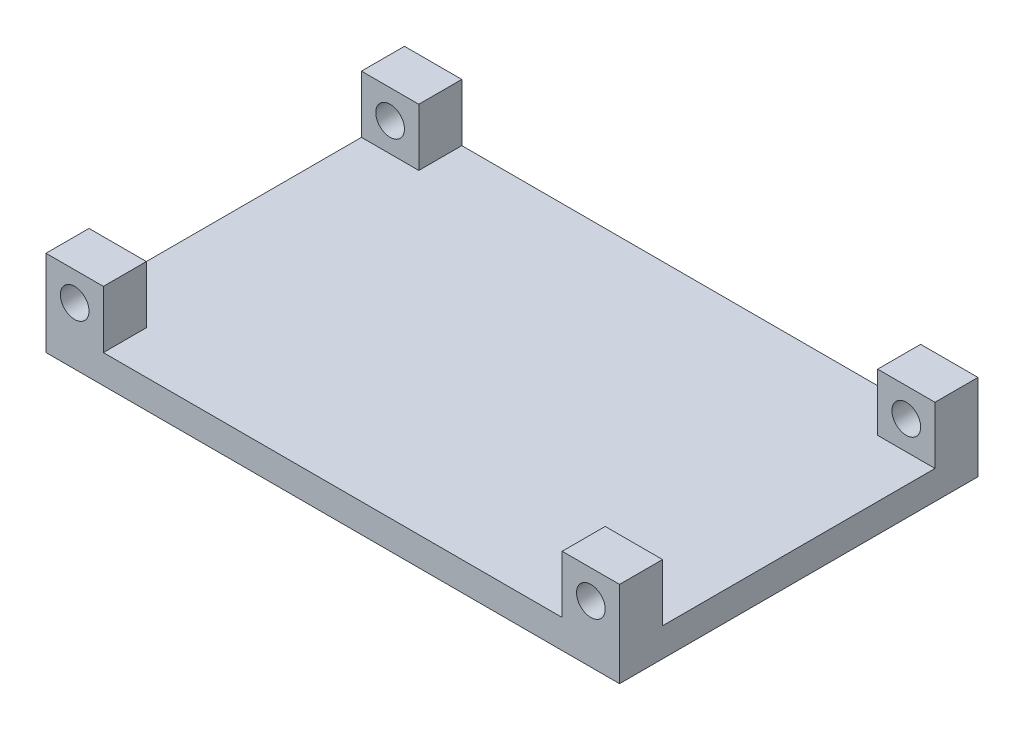
ISO-10303-21;
HEADER;
FILE_DESCRIPTION(('STEP AP214'),'2;1');
FILE_NAME('part.step','',(''),(''),'','','');
FILE_SCHEMA(('AUTOMOTIVE_DESIGN { 1 0 10303 214 1 1 1 1 }'));
ENDSEC;
DATA;
#1=APPLICATION_CONTEXT('core data for automotive mechanical design processes');
#2=APPLICATION_PROTOCOL_DEFINITION('international standard','automotive_design',2000,#1);
#3=PRODUCT_CONTEXT('',#1,'mechanical');
#4=PRODUCT('Part','Part','',(#3));
#5=PRODUCT_RELATED_PRODUCT_CATEGORY('part','',(#4));
#6=PRODUCT_DEFINITION_FORMATION('','',#4);
#7=PRODUCT_DEFINITION_CONTEXT('part definition',#1,'design');
#8=PRODUCT_DEFINITION('design','',#6,#7);
#9=PRODUCT_DEFINITION_SHAPE('','',#8);
#10=(LENGTH_UNIT() NAMED_UNIT(*) SI_UNIT(.MILLI.,.METRE.));
#11=(NAMED_UNIT(*) PLANE_ANGLE_UNIT() SI_UNIT($,.RADIAN.));
#12=(NAMED_UNIT(*) SI_UNIT($,.STERADIAN.) SOLID_ANGLE_UNIT());
#13=UNCERTAINTY_MEASURE_WITH_UNIT(LENGTH_MEASURE(1.E-05),#10,'distance_accuracy_value','');
#14=(GEOMETRIC_REPRESENTATION_CONTEXT(3) GLOBAL_UNCERTAINTY_ASSIGNED_CONTEXT((#13)) GLOBAL_UNIT_ASSIGNED_CONTEXT((#10,
#11,#12)) REPRESENTATION_CONTEXT('',''));
#15=CARTESIAN_POINT('',(0.,0.,0.));
#16=DIRECTION('',(0.,0.,1.));
#17=DIRECTION('',(1.,0.,0.));
#18=AXIS2_PLACEMENT_3D('',#15,#16,#17);
#19=CARTESIAN_POINT('',(0.,20.,0.));
#20=DIRECTION('',(0.,-1.,0.));
#21=DIRECTION('',(0.,0.,-1.));
#22=AXIS2_PLACEMENT_3D('',#19,#20,#21);
#23=PLANE('',#22);
#24=DIRECTION('',(1.,0.,0.));
#25=VECTOR('',#24,1.);
#26=CARTESIAN_POINT('',(200.,20.,-95.));
#27=LINE('',#26,#25);
#28=CARTESIAN_POINT('',(160.,20.,-95.));
#29=VERTEX_POINT('',#28);
#30=CARTESIAN_POINT('',(200.,20.,-95.));
#31=VERTEX_POINT('',#30);
#32=EDGE_CURVE('E145',#29,#31,#27,.T.);
#33=ORIENTED_EDGE('',*,*,#32,.F.);
#34=DIRECTION('',(0.,0.,-1.));
#35=VECTOR('',#34,1.);
#36=CARTESIAN_POINT('',(160.,20.,-95.));
#37=LINE('',#36,#35);
#38=CARTESIAN_POINT('',(160.,20.,-125.));
#39=VERTEX_POINT('',#38);
#40=EDGE_CURVE('E52',#29,#39,#37,.T.);
#41=ORIENTED_EDGE('',*,*,#40,.T.);
#42=DIRECTION('',(1.,0.,0.));
#43=VECTOR('',#42,1.);
#44=CARTESIAN_POINT('',(-200.,20.,-125.));
#45=LINE('',#44,#43);
#46=CARTESIAN_POINT('',(-160.,20.,-125.));
#47=VERTEX_POINT('',#46);
#48=EDGE_CURVE('E269',#47,#39,#45,.T.);
#49=ORIENTED_EDGE('',*,*,#48,.F.);
#50=DIRECTION('',(0.,0.,-1.));
#51=VECTOR('',#50,1.);
#52=CARTESIAN_POINT('',(-160.,20.,-95.));
#53=LINE('',#52,#51);
#54=CARTESIAN_POINT('',(-160.,20.,-95.));
#55=VERTEX_POINT('',#54);
#56=EDGE_CURVE('E194',#55,#47,#53,.T.);
#57=ORIENTED_EDGE('',*,*,#56,.F.);
#58=DIRECTION('',(1.,0.,0.));
#59=VECTOR('',#58,1.);
#60=CARTESIAN_POINT('',(-200.,20.,-95.));
#61=LINE('',#60,#59);
#62=CARTESIAN_POINT('',(-200.,20.,-95.));
#63=VERTEX_POINT('',#62);
#64=EDGE_CURVE('E187',#63,#55,#61,.T.);
#65=ORIENTED_EDGE('',*,*,#64,.F.);
#66=DIRECTION('',(0.,0.,-1.));
#67=VECTOR('',#66,1.);
#68=CARTESIAN_POINT('',(-200.,20.,125.));
#69=LINE('',#68,#67);
#70=CARTESIAN_POINT('',(-200.,20.,95.));
#71=VERTEX_POINT('',#70);
#72=EDGE_CURVE('E266',#71,#63,#69,.T.);
#73=ORIENTED_EDGE('',*,*,#72,.F.);
#74=DIRECTION('',(1.,0.,0.));
#75=VECTOR('',#74,1.);
#76=CARTESIAN_POINT('',(-200.,20.,95.));
#77=LINE('',#76,#75);
#78=CARTESIAN_POINT('',(-160.,20.,95.));
#79=VERTEX_POINT('',#78);
#80=EDGE_CURVE('E243',#71,#79,#77,.T.);
#81=ORIENTED_EDGE('',*,*,#80,.T.);
#82=DIRECTION('',(0.,0.,1.));
#83=VECTOR('',#82,1.);
#84=CARTESIAN_POINT('',(-160.,20.,95.));
#85=LINE('',#84,#83);
#86=CARTESIAN_POINT('',(-160.,20.,125.));
#87=VERTEX_POINT('',#86);
#88=EDGE_CURVE('E253',#79,#87,#85,.T.);
#89=ORIENTED_EDGE('',*,*,#88,.T.);
#90=DIRECTION('',(1.,0.,0.));
#91=VECTOR('',#90,1.);
#92=CARTESIAN_POINT('',(-200.,20.,125.));
#93=LINE('',#92,#91);
#94=CARTESIAN_POINT('',(160.,20.,125.));
#95=VERTEX_POINT('',#94);
#96=EDGE_CURVE('E273',#87,#95,#93,.T.);
#97=ORIENTED_EDGE('',*,*,#96,.T.);
#98=DIRECTION('',(0.,0.,1.));
#99=VECTOR('',#98,1.);
#100=CARTESIAN_POINT('',(160.,20.,95.));
#101=LINE('',#100,#99);
#102=CARTESIAN_POINT('',(160.,20.,95.));
#103=VERTEX_POINT('',#102);
#104=EDGE_CURVE('E226',#103,#95,#101,.T.);
#105=ORIENTED_EDGE('',*,*,#104,.F.);
#106=DIRECTION('',(1.,0.,0.));
#107=VECTOR('',#106,1.);
#108=CARTESIAN_POINT('',(200.,20.,95.));
#109=LINE('',#108,#107);
#110=CARTESIAN_POINT('',(200.,20.,95.));
#111=VERTEX_POINT('',#110);
#112=EDGE_CURVE('E219',#103,#111,#109,.T.);
#113=ORIENTED_EDGE('',*,*,#112,.T.);
#114=DIRECTION('',(0.,0.,-1.));
#115=VECTOR('',#114,1.);
#116=CARTESIAN_POINT('',(200.,20.,125.));
#117=LINE('',#116,#115);
#118=EDGE_CURVE('E58',#111,#31,#117,.T.);
#119=ORIENTED_EDGE('',*,*,#118,.T.);
#120=EDGE_LOOP('',(#33,#41,#49,#57,#65,#73,#81,#89,#97,#105,#113,#119));
#121=FACE_BOUND('',#120,.T.);
#122=ADVANCED_FACE('F35',(#121),#23,.F.);
#123=CARTESIAN_POINT('',(-200.,20.,125.));
#124=DIRECTION('',(-1.,0.,0.));
#125=DIRECTION('',(0.,0.,1.));
#126=AXIS2_PLACEMENT_3D('',#123,#124,#125);
#127=PLANE('',#126);
#128=DIRECTION('',(0.,0.,-1.));
#129=VECTOR('',#128,1.);
#130=CARTESIAN_POINT('',(-200.,0.,125.));
#131=LINE('',#130,#129);
#132=CARTESIAN_POINT('',(-200.,0.,125.));
#133=VERTEX_POINT('',#132);
#134=CARTESIAN_POINT('',(-200.,0.,-125.));
#135=VERTEX_POINT('',#134);
#136=EDGE_CURVE('E261',#133,#135,#131,.T.);
#137=ORIENTED_EDGE('',*,*,#136,.F.);
#138=DIRECTION('',(0.,-1.,0.));
#139=VECTOR('',#138,1.);
#140=CARTESIAN_POINT('',(-200.,20.,125.));
#141=LINE('',#140,#139);
#142=CARTESIAN_POINT('',(-200.,60.,125.));
#143=VERTEX_POINT('',#142);
#144=EDGE_CURVE('E11',#143,#133,#141,.T.);
#145=ORIENTED_EDGE('',*,*,#144,.F.);
#146=DIRECTION('',(0.,0.,1.));
#147=VECTOR('',#146,1.);
#148=CARTESIAN_POINT('',(-200.,60.,95.));
#149=LINE('',#148,#147);
#150=CARTESIAN_POINT('',(-200.,60.,95.));
#151=VERTEX_POINT('',#150);
#152=EDGE_CURVE('E258',#151,#143,#149,.T.);
#153=ORIENTED_EDGE('',*,*,#152,.F.);
#154=DIRECTION('',(0.,-1.,0.));
#155=VECTOR('',#154,1.);
#156=CARTESIAN_POINT('',(-200.,20.,95.));
#157=LINE('',#156,#155);
#158=EDGE_CURVE('E240',#151,#71,#157,.T.);
#159=ORIENTED_EDGE('',*,*,#158,.T.);
#160=ORIENTED_EDGE('',*,*,#72,.T.);
#161=DIRECTION('',(0.,-1.,0.));
#162=VECTOR('',#161,1.);
#163=CARTESIAN_POINT('',(-200.,20.,-95.));
#164=LINE('',#163,#162);
#165=CARTESIAN_POINT('',(-200.,60.,-95.));
#166=VERTEX_POINT('',#165);
#167=EDGE_CURVE('E179',#166,#63,#164,.T.);
#168=ORIENTED_EDGE('',*,*,#167,.F.);
#169=DIRECTION('',(0.,0.,-1.));
#170=VECTOR('',#169,1.);
#171=CARTESIAN_POINT('',(-200.,60.,-95.));
#172=LINE('',#171,#170);
#173=CARTESIAN_POINT('',(-200.,60.,-125.));
#174=VERTEX_POINT('',#173);
#175=EDGE_CURVE('E190',#166,#174,#172,.T.);
#176=ORIENTED_EDGE('',*,*,#175,.T.);
#177=DIRECTION('',(0.,-1.,0.));
#178=VECTOR('',#177,1.);
#179=CARTESIAN_POINT('',(-200.,20.,-125.));
#180=LINE('',#179,#178);
#181=EDGE_CURVE('E39',#174,#135,#180,.T.);
#182=ORIENTED_EDGE('',*,*,#181,.T.);
#183=EDGE_LOOP('',(#137,#145,#153,#159,#160,#168,#176,#182));
#184=FACE_BOUND('',#183,.T.);
#185=ADVANCED_FACE('F37',(#184),#127,.T.);
#186=CARTESIAN_POINT('',(-200.,20.,125.));
#187=DIRECTION('',(0.,0.,-1.));
#188=DIRECTION('',(-1.,0.,0.));
#189=AXIS2_PLACEMENT_3D('',#186,#187,#188);
#190=PLANE('',#189);
#191=DIRECTION('',(1.,0.,0.));
#192=VECTOR('',#191,1.);
#193=CARTESIAN_POINT('',(-200.,0.,125.));
#194=LINE('',#193,#192);
#195=CARTESIAN_POINT('',(200.,0.,125.));
#196=VERTEX_POINT('',#195);
#197=EDGE_CURVE('E270',#133,#196,#194,.T.);
#198=ORIENTED_EDGE('',*,*,#197,.T.);
#199=DIRECTION('',(0.,-1.,0.));
#200=VECTOR('',#199,1.);
#201=CARTESIAN_POINT('',(200.,20.,125.));
#202=LINE('',#201,#200);
#203=CARTESIAN_POINT('',(200.,60.,125.));
#204=VERTEX_POINT('',#203);
#205=EDGE_CURVE('E44',#204,#196,#202,.T.);
#206=ORIENTED_EDGE('',*,*,#205,.F.);
#207=DIRECTION('',(-1.,0.,0.));
#208=VECTOR('',#207,1.);
#209=CARTESIAN_POINT('',(200.,60.,125.));
#210=LINE('',#209,#208);
#211=CARTESIAN_POINT('',(160.,60.,125.));
#212=VERTEX_POINT('',#211);
#213=EDGE_CURVE('E206',#204,#212,#210,.T.);
#214=ORIENTED_EDGE('',*,*,#213,.T.);
#215=DIRECTION('',(0.,-1.,0.));
#216=VECTOR('',#215,1.);
#217=CARTESIAN_POINT('',(160.,20.,125.));
#218=LINE('',#217,#216);
#219=EDGE_CURVE('E213',#212,#95,#218,.T.);
#220=ORIENTED_EDGE('',*,*,#219,.T.);
#221=ORIENTED_EDGE('',*,*,#96,.F.);
#222=DIRECTION('',(0.,1.,0.));
#223=VECTOR('',#222,1.);
#224=CARTESIAN_POINT('',(-160.,20.,125.));
#225=LINE('',#224,#223);
#226=CARTESIAN_POINT('',(-160.,60.,125.));
#227=VERTEX_POINT('',#226);
#228=EDGE_CURVE('E237',#87,#227,#225,.T.);
#229=ORIENTED_EDGE('',*,*,#228,.T.);
#230=DIRECTION('',(-1.,0.,0.));
#231=VECTOR('',#230,1.);
#232=CARTESIAN_POINT('',(-200.,60.,125.));
#233=LINE('',#232,#231);
#234=EDGE_CURVE('E244',#227,#143,#233,.T.);
#235=ORIENTED_EDGE('',*,*,#234,.T.);
#236=ORIENTED_EDGE('',*,*,#144,.T.);
#237=EDGE_LOOP('',(#198,#206,#214,#220,#221,#229,#235,#236));
#238=FACE_BOUND('',#237,.T.);
#239=CARTESIAN_POINT('',(-180.,40.,125.));
#240=DIRECTION('',(0.,0.,1.));
#241=DIRECTION('',(1.,0.,0.));
#242=AXIS2_PLACEMENT_3D('',#239,#240,#241);
#243=CIRCLE('',#242,10.);
#244=CARTESIAN_POINT('',(-170.,40.,125.));
#245=VERTEX_POINT('',#244);
#246=EDGE_CURVE('E229',#245,#245,#243,.T.);
#247=ORIENTED_EDGE('',*,*,#246,.F.);
#248=EDGE_LOOP('',(#247));
#249=FACE_BOUND('',#248,.T.);
#250=CARTESIAN_POINT('',(180.,40.,125.));
#251=DIRECTION('',(0.,0.,1.));
#252=DIRECTION('',(1.,0.,0.));
#253=AXIS2_PLACEMENT_3D('',#250,#251,#252);
#254=CIRCLE('',#253,10.);
#255=CARTESIAN_POINT('',(190.,40.,125.));
#256=VERTEX_POINT('',#255);
#257=EDGE_CURVE('E197',#256,#256,#254,.T.);
#258=ORIENTED_EDGE('',*,*,#257,.F.);
#259=EDGE_LOOP('',(#258));
#260=FACE_BOUND('',#259,.T.);
#261=ADVANCED_FACE('F301',(#238,#249,#260),#190,.F.);
#262=CARTESIAN_POINT('',(200.,20.,125.));
#263=DIRECTION('',(-1.,0.,0.));
#264=DIRECTION('',(0.,0.,1.));
#265=AXIS2_PLACEMENT_3D('',#262,#263,#264);
#266=PLANE('',#265);
#267=DIRECTION('',(0.,0.,-1.));
#268=VECTOR('',#267,1.);
#269=CARTESIAN_POINT('',(200.,0.,125.));
#270=LINE('',#269,#268);
#271=CARTESIAN_POINT('',(200.,0.,-125.));
#272=VERTEX_POINT('',#271);
#273=EDGE_CURVE('E280',#196,#272,#270,.T.);
#274=ORIENTED_EDGE('',*,*,#273,.T.);
#275=DIRECTION('',(0.,-1.,0.));
#276=VECTOR('',#275,1.);
#277=CARTESIAN_POINT('',(200.,20.,-125.));
#278=LINE('',#277,#276);
#279=CARTESIAN_POINT('',(200.,60.,-125.));
#280=VERTEX_POINT('',#279);
#281=EDGE_CURVE('E285',#280,#272,#278,.T.);
#282=ORIENTED_EDGE('',*,*,#281,.F.);
#283=DIRECTION('',(0.,0.,-1.));
#284=VECTOR('',#283,1.);
#285=CARTESIAN_POINT('',(200.,60.,-95.));
#286=LINE('',#285,#284);
#287=CARTESIAN_POINT('',(200.,60.,-95.));
#288=VERTEX_POINT('',#287);
#289=EDGE_CURVE('E167',#288,#280,#286,.T.);
#290=ORIENTED_EDGE('',*,*,#289,.F.);
#291=DIRECTION('',(0.,1.,0.));
#292=VECTOR('',#291,1.);
#293=CARTESIAN_POINT('',(200.,20.,-95.));
#294=LINE('',#293,#292);
#295=EDGE_CURVE('E151',#31,#288,#294,.T.);
#296=ORIENTED_EDGE('',*,*,#295,.F.);
#297=ORIENTED_EDGE('',*,*,#118,.F.);
#298=DIRECTION('',(0.,1.,0.));
#299=VECTOR('',#298,1.);
#300=CARTESIAN_POINT('',(200.,20.,95.));
#301=LINE('',#300,#299);
#302=CARTESIAN_POINT('',(200.,60.,95.));
#303=VERTEX_POINT('',#302);
#304=EDGE_CURVE('E209',#111,#303,#301,.T.);
#305=ORIENTED_EDGE('',*,*,#304,.T.);
#306=DIRECTION('',(0.,0.,1.));
#307=VECTOR('',#306,1.);
#308=CARTESIAN_POINT('',(200.,60.,95.));
#309=LINE('',#308,#307);
#310=EDGE_CURVE('E221',#303,#204,#309,.T.);
#311=ORIENTED_EDGE('',*,*,#310,.T.);
#312=ORIENTED_EDGE('',*,*,#205,.T.);
#313=EDGE_LOOP('',(#274,#282,#290,#296,#297,#305,#311,#312));
#314=FACE_BOUND('',#313,.T.);
#315=ADVANCED_FACE('F304',(#314),#266,.F.);
#316=CARTESIAN_POINT('',(-200.,20.,-125.));
#317=DIRECTION('',(0.,0.,-1.));
#318=DIRECTION('',(-1.,0.,0.));
#319=AXIS2_PLACEMENT_3D('',#316,#317,#318);
#320=PLANE('',#319);
#321=DIRECTION('',(1.,0.,0.));
#322=VECTOR('',#321,1.);
#323=CARTESIAN_POINT('',(-200.,0.,-125.));
#324=LINE('',#323,#322);
#325=EDGE_CURVE('E277',#135,#272,#324,.T.);
#326=ORIENTED_EDGE('',*,*,#325,.F.);
#327=ORIENTED_EDGE('',*,*,#181,.F.);
#328=DIRECTION('',(-1.,0.,0.));
#329=VECTOR('',#328,1.);
#330=CARTESIAN_POINT('',(-200.,60.,-125.));
#331=LINE('',#330,#329);
#332=CARTESIAN_POINT('',(-160.,60.,-125.));
#333=VERTEX_POINT('',#332);
#334=EDGE_CURVE('E175',#333,#174,#331,.T.);
#335=ORIENTED_EDGE('',*,*,#334,.F.);
#336=DIRECTION('',(0.,1.,0.));
#337=VECTOR('',#336,1.);
#338=CARTESIAN_POINT('',(-160.,20.,-125.));
#339=LINE('',#338,#337);
#340=EDGE_CURVE('E183',#47,#333,#339,.T.);
#341=ORIENTED_EDGE('',*,*,#340,.F.);
#342=ORIENTED_EDGE('',*,*,#48,.T.);
#343=DIRECTION('',(0.,-1.,0.));
#344=VECTOR('',#343,1.);
#345=CARTESIAN_POINT('',(160.,20.,-125.));
#346=LINE('',#345,#344);
#347=CARTESIAN_POINT('',(160.,60.,-125.));
#348=VERTEX_POINT('',#347);
#349=EDGE_CURVE('E164',#348,#39,#346,.T.);
#350=ORIENTED_EDGE('',*,*,#349,.F.);
#351=DIRECTION('',(-1.,0.,0.));
#352=VECTOR('',#351,1.);
#353=CARTESIAN_POINT('',(200.,60.,-125.));
#354=LINE('',#353,#352);
#355=EDGE_CURVE('E338',#280,#348,#354,.T.);
#356=ORIENTED_EDGE('',*,*,#355,.F.);
#357=ORIENTED_EDGE('',*,*,#281,.T.);
#358=EDGE_LOOP('',(#326,#327,#335,#341,#342,#350,#356,#357));
#359=FACE_BOUND('',#358,.T.);
#360=CARTESIAN_POINT('',(-180.,40.,-125.));
#361=DIRECTION('',(0.,0.,1.));
#362=DIRECTION('',(1.,0.,0.));
#363=AXIS2_PLACEMENT_3D('',#360,#361,#362);
#364=CIRCLE('',#363,10.);
#365=CARTESIAN_POINT('',(-170.,40.,-125.));
#366=VERTEX_POINT('',#365);
#367=EDGE_CURVE('E176',#366,#366,#364,.T.);
#368=ORIENTED_EDGE('',*,*,#367,.T.);
#369=EDGE_LOOP('',(#368));
#370=FACE_BOUND('',#369,.T.);
#371=CARTESIAN_POINT('',(180.,40.,-125.));
#372=DIRECTION('',(0.,0.,1.));
#373=DIRECTION('',(1.,0.,0.));
#374=AXIS2_PLACEMENT_3D('',#371,#372,#373);
#375=CIRCLE('',#374,10.);
#376=CARTESIAN_POINT('',(190.,40.,-125.));
#377=VERTEX_POINT('',#376);
#378=EDGE_CURVE('E344',#377,#377,#375,.T.);
#379=ORIENTED_EDGE('',*,*,#378,.T.);
#380=EDGE_LOOP('',(#379));
#381=FACE_BOUND('',#380,.T.);
#382=ADVANCED_FACE('F294',(#359,#370,#381),#320,.T.);
#383=CARTESIAN_POINT('',(0.,0.,0.));
#384=DIRECTION('',(0.,-1.,0.));
#385=DIRECTION('',(0.,0.,-1.));
#386=AXIS2_PLACEMENT_3D('',#383,#384,#385);
#387=PLANE('',#386);
#388=ORIENTED_EDGE('',*,*,#136,.T.);
#389=ORIENTED_EDGE('',*,*,#325,.T.);
#390=ORIENTED_EDGE('',*,*,#273,.F.);
#391=ORIENTED_EDGE('',*,*,#197,.F.);
#392=EDGE_LOOP('',(#388,#389,#390,#391));
#393=FACE_BOUND('',#392,.T.);
#394=ADVANCED_FACE('F299',(#393),#387,.T.);
#395=CARTESIAN_POINT('',(-200.,60.,95.));
#396=DIRECTION('',(0.,1.,0.));
#397=DIRECTION('',(0.,0.,1.));
#398=AXIS2_PLACEMENT_3D('',#395,#396,#397);
#399=PLANE('',#398);
#400=ORIENTED_EDGE('',*,*,#234,.F.);
#401=DIRECTION('',(0.,0.,1.));
#402=VECTOR('',#401,1.);
#403=CARTESIAN_POINT('',(-160.,60.,95.));
#404=LINE('',#403,#402);
#405=CARTESIAN_POINT('',(-160.,60.,95.));
#406=VERTEX_POINT('',#405);
#407=EDGE_CURVE('E262',#406,#227,#404,.T.);
#408=ORIENTED_EDGE('',*,*,#407,.F.);
#409=DIRECTION('',(-1.,0.,0.));
#410=VECTOR('',#409,1.);
#411=CARTESIAN_POINT('',(-200.,60.,95.));
#412=LINE('',#411,#410);
#413=EDGE_CURVE('E250',#406,#151,#412,.T.);
#414=ORIENTED_EDGE('',*,*,#413,.T.);
#415=ORIENTED_EDGE('',*,*,#152,.T.);
#416=EDGE_LOOP('',(#400,#408,#414,#415));
#417=FACE_BOUND('',#416,.T.);
#418=ADVANCED_FACE('F326',(#417),#399,.T.);
#419=CARTESIAN_POINT('',(-160.,20.,95.));
#420=DIRECTION('',(1.,0.,0.));
#421=DIRECTION('',(0.,0.,-1.));
#422=AXIS2_PLACEMENT_3D('',#419,#420,#421);
#423=PLANE('',#422);
#424=ORIENTED_EDGE('',*,*,#228,.F.);
#425=ORIENTED_EDGE('',*,*,#88,.F.);
#426=DIRECTION('',(0.,1.,0.));
#427=VECTOR('',#426,1.);
#428=CARTESIAN_POINT('',(-160.,20.,95.));
#429=LINE('',#428,#427);
#430=EDGE_CURVE('E247',#79,#406,#429,.T.);
#431=ORIENTED_EDGE('',*,*,#430,.T.);
#432=ORIENTED_EDGE('',*,*,#407,.T.);
#433=EDGE_LOOP('',(#424,#425,#431,#432));
#434=FACE_BOUND('',#433,.T.);
#435=ADVANCED_FACE('F319',(#434),#423,.T.);
#436=CARTESIAN_POINT('',(0.,0.,95.));
#437=DIRECTION('',(0.,0.,-1.));
#438=DIRECTION('',(-1.,0.,0.));
#439=AXIS2_PLACEMENT_3D('',#436,#437,#438);
#440=PLANE('',#439);
#441=CARTESIAN_POINT('',(-180.,40.,95.));
#442=DIRECTION('',(0.,0.,1.));
#443=DIRECTION('',(1.,0.,0.));
#444=AXIS2_PLACEMENT_3D('',#441,#442,#443);
#445=CIRCLE('',#444,10.);
#446=CARTESIAN_POINT('',(-170.,40.,95.));
#447=VERTEX_POINT('',#446);
#448=EDGE_CURVE('E234',#447,#447,#445,.T.);
#449=ORIENTED_EDGE('',*,*,#448,.T.);
#450=EDGE_LOOP('',(#449));
#451=FACE_BOUND('',#450,.T.);
#452=ORIENTED_EDGE('',*,*,#158,.F.);
#453=ORIENTED_EDGE('',*,*,#413,.F.);
#454=ORIENTED_EDGE('',*,*,#430,.F.);
#455=ORIENTED_EDGE('',*,*,#80,.F.);
#456=EDGE_LOOP('',(#452,#453,#454,#455));
#457=FACE_BOUND('',#456,.T.);
#458=ADVANCED_FACE('F323',(#451,#457),#440,.T.);
#459=CARTESIAN_POINT('',(-180.,40.,95.));
#460=DIRECTION('',(0.,0.,1.));
#461=DIRECTION('',(1.,0.,0.));
#462=AXIS2_PLACEMENT_3D('',#459,#460,#461);
#463=CYLINDRICAL_SURFACE('',#462,10.);
#464=ORIENTED_EDGE('',*,*,#448,.F.);
#465=EDGE_LOOP('',(#464));
#466=FACE_BOUND('',#465,.T.);
#467=ORIENTED_EDGE('',*,*,#246,.T.);
#468=EDGE_LOOP('',(#467));
#469=FACE_BOUND('',#468,.T.);
#470=ADVANCED_FACE('F402',(#466,#469),#463,.F.);
#471=CARTESIAN_POINT('',(160.,20.,95.));
#472=DIRECTION('',(-1.,0.,0.));
#473=DIRECTION('',(0.,0.,1.));
#474=AXIS2_PLACEMENT_3D('',#471,#472,#473);
#475=PLANE('',#474);
#476=ORIENTED_EDGE('',*,*,#219,.F.);
#477=DIRECTION('',(0.,0.,1.));
#478=VECTOR('',#477,1.);
#479=CARTESIAN_POINT('',(160.,60.,95.));
#480=LINE('',#479,#478);
#481=CARTESIAN_POINT('',(160.,60.,95.));
#482=VERTEX_POINT('',#481);
#483=EDGE_CURVE('E230',#482,#212,#480,.T.);
#484=ORIENTED_EDGE('',*,*,#483,.F.);
#485=DIRECTION('',(0.,-1.,0.));
#486=VECTOR('',#485,1.);
#487=CARTESIAN_POINT('',(160.,20.,95.));
#488=LINE('',#487,#486);
#489=EDGE_CURVE('E216',#482,#103,#488,.T.);
#490=ORIENTED_EDGE('',*,*,#489,.T.);
#491=ORIENTED_EDGE('',*,*,#104,.T.);
#492=EDGE_LOOP('',(#476,#484,#490,#491));
#493=FACE_BOUND('',#492,.T.);
#494=ADVANCED_FACE('F313',(#493),#475,.T.);
#495=CARTESIAN_POINT('',(200.,60.,95.));
#496=DIRECTION('',(0.,1.,0.));
#497=DIRECTION('',(-1.,0.,0.));
#498=AXIS2_PLACEMENT_3D('',#495,#496,#497);
#499=PLANE('',#498);
#500=ORIENTED_EDGE('',*,*,#213,.F.);
#501=ORIENTED_EDGE('',*,*,#310,.F.);
#502=DIRECTION('',(-1.,0.,0.));
#503=VECTOR('',#502,1.);
#504=CARTESIAN_POINT('',(200.,60.,95.));
#505=LINE('',#504,#503);
#506=EDGE_CURVE('E212',#303,#482,#505,.T.);
#507=ORIENTED_EDGE('',*,*,#506,.T.);
#508=ORIENTED_EDGE('',*,*,#483,.T.);
#509=EDGE_LOOP('',(#500,#501,#507,#508));
#510=FACE_BOUND('',#509,.T.);
#511=ADVANCED_FACE('F309',(#510),#499,.T.);
#512=CARTESIAN_POINT('',(0.,0.,95.));
#513=DIRECTION('',(0.,0.,1.));
#514=DIRECTION('',(1.,0.,0.));
#515=AXIS2_PLACEMENT_3D('',#512,#513,#514);
#516=PLANE('',#515);
#517=CARTESIAN_POINT('',(180.,40.,95.));
#518=DIRECTION('',(0.,0.,1.));
#519=DIRECTION('',(1.,0.,0.));
#520=AXIS2_PLACEMENT_3D('',#517,#518,#519);
#521=CIRCLE('',#520,10.);
#522=CARTESIAN_POINT('',(190.,40.,95.));
#523=VERTEX_POINT('',#522);
#524=EDGE_CURVE('E203',#523,#523,#521,.T.);
#525=ORIENTED_EDGE('',*,*,#524,.T.);
#526=EDGE_LOOP('',(#525));
#527=FACE_BOUND('',#526,.T.);
#528=ORIENTED_EDGE('',*,*,#304,.F.);
#529=ORIENTED_EDGE('',*,*,#112,.F.);
#530=ORIENTED_EDGE('',*,*,#489,.F.);
#531=ORIENTED_EDGE('',*,*,#506,.F.);
#532=EDGE_LOOP('',(#528,#529,#530,#531));
#533=FACE_BOUND('',#532,.T.);
#534=ADVANCED_FACE('F423',(#527,#533),#516,.F.);
#535=CARTESIAN_POINT('',(180.,40.,95.));
#536=DIRECTION('',(0.,0.,1.));
#537=DIRECTION('',(1.,0.,0.));
#538=AXIS2_PLACEMENT_3D('',#535,#536,#537);
#539=CYLINDRICAL_SURFACE('',#538,10.);
#540=ORIENTED_EDGE('',*,*,#524,.F.);
#541=EDGE_LOOP('',(#540));
#542=FACE_BOUND('',#541,.T.);
#543=ORIENTED_EDGE('',*,*,#257,.T.);
#544=EDGE_LOOP('',(#543));
#545=FACE_BOUND('',#544,.T.);
#546=ADVANCED_FACE('F430',(#542,#545),#539,.F.);
#547=CARTESIAN_POINT('',(0.,0.,-95.));
#548=DIRECTION('',(0.,0.,1.));
#549=DIRECTION('',(-1.,0.,0.));
#550=AXIS2_PLACEMENT_3D('',#547,#548,#549);
#551=PLANE('',#550);
#552=ORIENTED_EDGE('',*,*,#167,.T.);
#553=ORIENTED_EDGE('',*,*,#64,.T.);
#554=DIRECTION('',(0.,1.,0.));
#555=VECTOR('',#554,1.);
#556=CARTESIAN_POINT('',(-160.,20.,-95.));
#557=LINE('',#556,#555);
#558=CARTESIAN_POINT('',(-160.,60.,-95.));
#559=VERTEX_POINT('',#558);
#560=EDGE_CURVE('E185',#55,#559,#557,.T.);
#561=ORIENTED_EDGE('',*,*,#560,.T.);
#562=DIRECTION('',(-1.,0.,0.));
#563=VECTOR('',#562,1.);
#564=CARTESIAN_POINT('',(-200.,60.,-95.));
#565=LINE('',#564,#563);
#566=EDGE_CURVE('E182',#559,#166,#565,.T.);
#567=ORIENTED_EDGE('',*,*,#566,.T.);
#568=EDGE_LOOP('',(#552,#553,#561,#567));
#569=FACE_BOUND('',#568,.T.);
#570=CARTESIAN_POINT('',(-180.,40.,-95.));
#571=DIRECTION('',(0.,0.,1.));
#572=DIRECTION('',(1.,0.,0.));
#573=AXIS2_PLACEMENT_3D('',#570,#571,#572);
#574=CIRCLE('',#573,10.);
#575=CARTESIAN_POINT('',(-170.,40.,-95.));
#576=VERTEX_POINT('',#575);
#577=EDGE_CURVE('E172',#576,#576,#574,.T.);
#578=ORIENTED_EDGE('',*,*,#577,.F.);
#579=EDGE_LOOP('',(#578));
#580=FACE_BOUND('',#579,.T.);
#581=ADVANCED_FACE('F329',(#569,#580),#551,.T.);
#582=CARTESIAN_POINT('',(-160.,20.,-95.));
#583=DIRECTION('',(-1.,0.,0.));
#584=DIRECTION('',(0.,0.,1.));
#585=AXIS2_PLACEMENT_3D('',#582,#583,#584);
#586=PLANE('',#585);
#587=ORIENTED_EDGE('',*,*,#340,.T.);
#588=DIRECTION('',(0.,0.,-1.));
#589=VECTOR('',#588,1.);
#590=CARTESIAN_POINT('',(-160.,60.,-95.));
#591=LINE('',#590,#589);
#592=EDGE_CURVE('E198',#559,#333,#591,.T.);
#593=ORIENTED_EDGE('',*,*,#592,.F.);
#594=ORIENTED_EDGE('',*,*,#560,.F.);
#595=ORIENTED_EDGE('',*,*,#56,.T.);
#596=EDGE_LOOP('',(#587,#593,#594,#595));
#597=FACE_BOUND('',#596,.T.);
#598=ADVANCED_FACE('F333',(#597),#586,.F.);
#599=CARTESIAN_POINT('',(-200.,60.,-95.));
#600=DIRECTION('',(0.,-1.,0.));
#601=DIRECTION('',(0.,0.,-1.));
#602=AXIS2_PLACEMENT_3D('',#599,#600,#601);
#603=PLANE('',#602);
#604=ORIENTED_EDGE('',*,*,#334,.T.);
#605=ORIENTED_EDGE('',*,*,#175,.F.);
#606=ORIENTED_EDGE('',*,*,#566,.F.);
#607=ORIENTED_EDGE('',*,*,#592,.T.);
#608=EDGE_LOOP('',(#604,#605,#606,#607));
#609=FACE_BOUND('',#608,.T.);
#610=ADVANCED_FACE('F337',(#609),#603,.F.);
#611=CARTESIAN_POINT('',(-180.,40.,-95.));
#612=DIRECTION('',(0.,0.,-1.));
#613=DIRECTION('',(-1.,0.,0.));
#614=AXIS2_PLACEMENT_3D('',#611,#612,#613);
#615=CYLINDRICAL_SURFACE('',#614,10.);
#616=ORIENTED_EDGE('',*,*,#577,.T.);
#617=EDGE_LOOP('',(#616));
#618=FACE_BOUND('',#617,.T.);
#619=ORIENTED_EDGE('',*,*,#367,.F.);
#620=EDGE_LOOP('',(#619));
#621=FACE_BOUND('',#620,.T.);
#622=ADVANCED_FACE('F455',(#618,#621),#615,.F.);
#623=CARTESIAN_POINT('',(0.,0.,-95.));
#624=DIRECTION('',(0.,0.,-1.));
#625=DIRECTION('',(1.,0.,0.));
#626=AXIS2_PLACEMENT_3D('',#623,#624,#625);
#627=PLANE('',#626);
#628=ORIENTED_EDGE('',*,*,#295,.T.);
#629=DIRECTION('',(-1.,0.,0.));
#630=VECTOR('',#629,1.);
#631=CARTESIAN_POINT('',(200.,60.,-95.));
#632=LINE('',#631,#630);
#633=CARTESIAN_POINT('',(160.,60.,-95.));
#634=VERTEX_POINT('',#633);
#635=EDGE_CURVE('E156',#288,#634,#632,.T.);
#636=ORIENTED_EDGE('',*,*,#635,.T.);
#637=DIRECTION('',(0.,-1.,0.));
#638=VECTOR('',#637,1.);
#639=CARTESIAN_POINT('',(160.,20.,-95.));
#640=LINE('',#639,#638);
#641=EDGE_CURVE('E150',#634,#29,#640,.T.);
#642=ORIENTED_EDGE('',*,*,#641,.T.);
#643=ORIENTED_EDGE('',*,*,#32,.T.);
#644=EDGE_LOOP('',(#628,#636,#642,#643));
#645=FACE_BOUND('',#644,.T.);
#646=CARTESIAN_POINT('',(180.,40.,-95.));
#647=DIRECTION('',(0.,0.,1.));
#648=DIRECTION('',(1.,0.,0.));
#649=AXIS2_PLACEMENT_3D('',#646,#647,#648);
#650=CIRCLE('',#649,10.);
#651=CARTESIAN_POINT('',(190.,40.,-95.));
#652=VERTEX_POINT('',#651);
#653=EDGE_CURVE('E340',#652,#652,#650,.T.);
#654=ORIENTED_EDGE('',*,*,#653,.F.);
#655=EDGE_LOOP('',(#654));
#656=FACE_BOUND('',#655,.T.);
#657=ADVANCED_FACE('F154',(#645,#656),#627,.F.);
#658=CARTESIAN_POINT('',(200.,60.,-95.));
#659=DIRECTION('',(0.,-1.,0.));
#660=DIRECTION('',(1.,0.,0.));
#661=AXIS2_PLACEMENT_3D('',#658,#659,#660);
#662=PLANE('',#661);
#663=ORIENTED_EDGE('',*,*,#355,.T.);
#664=DIRECTION('',(0.,0.,-1.));
#665=VECTOR('',#664,1.);
#666=CARTESIAN_POINT('',(160.,60.,-95.));
#667=LINE('',#666,#665);
#668=EDGE_CURVE('E165',#634,#348,#667,.T.);
#669=ORIENTED_EDGE('',*,*,#668,.F.);
#670=ORIENTED_EDGE('',*,*,#635,.F.);
#671=ORIENTED_EDGE('',*,*,#289,.T.);
#672=EDGE_LOOP('',(#663,#669,#670,#671));
#673=FACE_BOUND('',#672,.T.);
#674=ADVANCED_FACE('F348',(#673),#662,.F.);
#675=CARTESIAN_POINT('',(160.,20.,-95.));
#676=DIRECTION('',(1.,0.,0.));
#677=DIRECTION('',(0.,0.,-1.));
#678=AXIS2_PLACEMENT_3D('',#675,#676,#677);
#679=PLANE('',#678);
#680=ORIENTED_EDGE('',*,*,#349,.T.);
#681=ORIENTED_EDGE('',*,*,#40,.F.);
#682=ORIENTED_EDGE('',*,*,#641,.F.);
#683=ORIENTED_EDGE('',*,*,#668,.T.);
#684=EDGE_LOOP('',(#680,#681,#682,#683));
#685=FACE_BOUND('',#684,.T.);
#686=ADVANCED_FACE('F162',(#685),#679,.F.);
#687=CARTESIAN_POINT('',(180.,40.,-95.));
#688=DIRECTION('',(0.,0.,-1.));
#689=DIRECTION('',(-1.,0.,0.));
#690=AXIS2_PLACEMENT_3D('',#687,#688,#689);
#691=CYLINDRICAL_SURFACE('',#690,10.);
#692=ORIENTED_EDGE('',*,*,#653,.T.);
#693=EDGE_LOOP('',(#692));
#694=FACE_BOUND('',#693,.T.);
#695=ORIENTED_EDGE('',*,*,#378,.F.);
#696=EDGE_LOOP('',(#695));
#697=FACE_BOUND('',#696,.T.);
#698=ADVANCED_FACE('F355',(#694,#697),#691,.F.);
#699=CLOSED_SHELL('',(#122,#185,#261,#315,#382,#394,#418,#435,#458,#470,#494,#511,#534,#546,
#581,#598,#610,#622,#657,#674,#686,#698));
#700=MANIFOLD_SOLID_BREP('B2',#699);
#701=ADVANCED_BREP_SHAPE_REPRESENTATION('',(#18,#700),#14);
#702=SHAPE_DEFINITION_REPRESENTATION(#9,#701);
ENDSEC;
END-ISO-10303-21;
